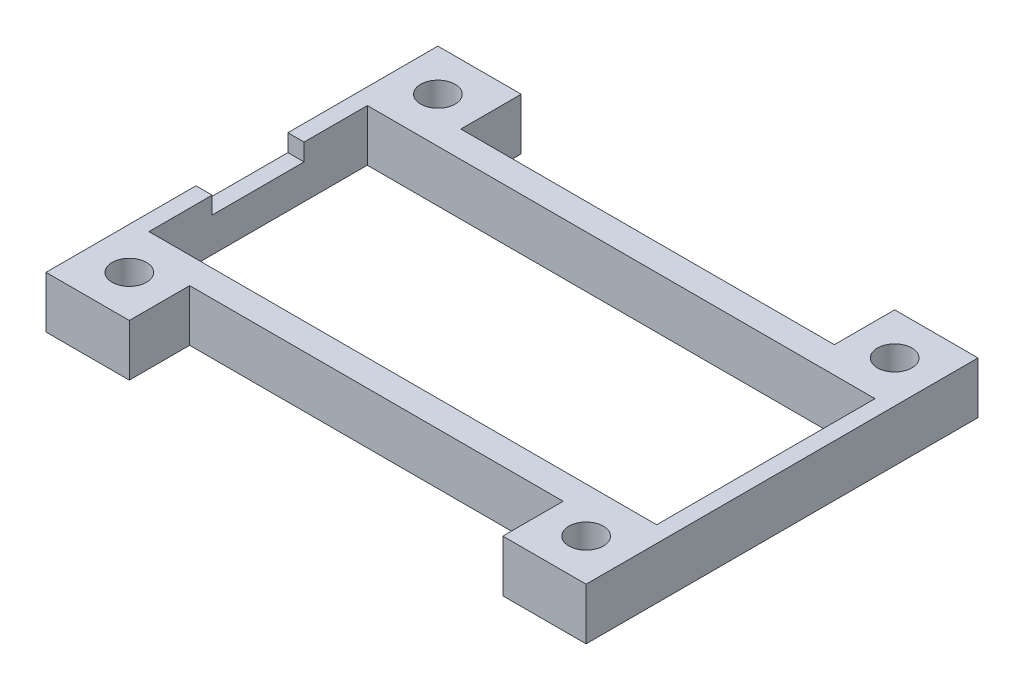
ISO-10303-21;
HEADER;
FILE_DESCRIPTION(('STEP AP214'),'2;1');
FILE_NAME('part.step','',(''),(''),'','','');
FILE_SCHEMA(('AUTOMOTIVE_DESIGN { 1 0 10303 214 1 1 1 1 }'));
ENDSEC;
DATA;
#1=APPLICATION_CONTEXT('core data for automotive mechanical design processes');
#2=APPLICATION_PROTOCOL_DEFINITION('international standard','automotive_design',2000,#1);
#3=PRODUCT_CONTEXT('',#1,'mechanical');
#4=PRODUCT('Part','Part','',(#3));
#5=PRODUCT_RELATED_PRODUCT_CATEGORY('part','',(#4));
#6=PRODUCT_DEFINITION_FORMATION('','',#4);
#7=PRODUCT_DEFINITION_CONTEXT('part definition',#1,'design');
#8=PRODUCT_DEFINITION('design','',#6,#7);
#9=PRODUCT_DEFINITION_SHAPE('','',#8);
#10=(LENGTH_UNIT() NAMED_UNIT(*) SI_UNIT(.MILLI.,.METRE.));
#11=(NAMED_UNIT(*) PLANE_ANGLE_UNIT() SI_UNIT($,.RADIAN.));
#12=(NAMED_UNIT(*) SI_UNIT($,.STERADIAN.) SOLID_ANGLE_UNIT());
#13=UNCERTAINTY_MEASURE_WITH_UNIT(LENGTH_MEASURE(1.E-05),#10,'distance_accuracy_value','');
#14=(GEOMETRIC_REPRESENTATION_CONTEXT(3) GLOBAL_UNCERTAINTY_ASSIGNED_CONTEXT((#13)) GLOBAL_UNIT_ASSIGNED_CONTEXT((#10,
#11,#12)) REPRESENTATION_CONTEXT('',''));
#15=CARTESIAN_POINT('',(0.,0.,0.));
#16=DIRECTION('',(0.,0.,1.));
#17=DIRECTION('',(1.,0.,0.));
#18=AXIS2_PLACEMENT_3D('',#15,#16,#17);
#19=CARTESIAN_POINT('',(-1.41,4.5,-21.3));
#20=DIRECTION('',(0.,0.,1.));
#21=DIRECTION('',(1.,0.,0.));
#22=AXIS2_PLACEMENT_3D('',#19,#20,#21);
#23=PLANE('',#22);
#24=DIRECTION('',(0.,-1.,0.));
#25=VECTOR('',#24,1.);
#26=CARTESIAN_POINT('',(5.84,4.5,-21.3));
#27=LINE('',#26,#25);
#28=CARTESIAN_POINT('',(5.84,4.5,-21.3));
#29=VERTEX_POINT('',#28);
#30=CARTESIAN_POINT('',(5.84,0.,-21.3));
#31=VERTEX_POINT('',#30);
#32=EDGE_CURVE('E218',#29,#31,#27,.T.);
#33=ORIENTED_EDGE('',*,*,#32,.F.);
#34=DIRECTION('',(-1.,0.,0.));
#35=VECTOR('',#34,1.);
#36=CARTESIAN_POINT('',(-1.41,4.5,-21.3));
#37=LINE('',#36,#35);
#38=CARTESIAN_POINT('',(38.34,4.5,-21.3));
#39=VERTEX_POINT('',#38);
#40=EDGE_CURVE('E11',#39,#29,#37,.T.);
#41=ORIENTED_EDGE('',*,*,#40,.F.);
#42=DIRECTION('',(0.,1.,0.));
#43=VECTOR('',#42,1.);
#44=CARTESIAN_POINT('',(38.34,4.5,-21.3));
#45=LINE('',#44,#43);
#46=CARTESIAN_POINT('',(38.34,0.,-21.3));
#47=VERTEX_POINT('',#46);
#48=EDGE_CURVE('E57',#47,#39,#45,.T.);
#49=ORIENTED_EDGE('',*,*,#48,.F.);
#50=DIRECTION('',(-1.,0.,0.));
#51=VECTOR('',#50,1.);
#52=CARTESIAN_POINT('',(-1.41,0.,-21.3));
#53=LINE('',#52,#51);
#54=EDGE_CURVE('E316',#47,#31,#53,.T.);
#55=ORIENTED_EDGE('',*,*,#54,.T.);
#56=EDGE_LOOP('',(#33,#41,#49,#55));
#57=FACE_BOUND('',#56,.T.);
#58=ADVANCED_FACE('F32',(#57),#23,.F.);
#59=CARTESIAN_POINT('',(-1.41,4.5,2.3));
#60=DIRECTION('',(0.,0.,-1.));
#61=DIRECTION('',(-1.,0.,0.));
#62=AXIS2_PLACEMENT_3D('',#59,#60,#61);
#63=PLANE('',#62);
#64=DIRECTION('',(0.,-1.,0.));
#65=VECTOR('',#64,1.);
#66=CARTESIAN_POINT('',(38.34,4.5,2.3));
#67=LINE('',#66,#65);
#68=CARTESIAN_POINT('',(38.34,4.5,2.3));
#69=VERTEX_POINT('',#68);
#70=CARTESIAN_POINT('',(38.34,0.,2.3));
#71=VERTEX_POINT('',#70);
#72=EDGE_CURVE('E257',#69,#71,#67,.T.);
#73=ORIENTED_EDGE('',*,*,#72,.F.);
#74=DIRECTION('',(1.,0.,0.));
#75=VECTOR('',#74,1.);
#76=CARTESIAN_POINT('',(-1.41,4.5,2.3));
#77=LINE('',#76,#75);
#78=CARTESIAN_POINT('',(5.84,4.5,2.3));
#79=VERTEX_POINT('',#78);
#80=EDGE_CURVE('E332',#79,#69,#77,.T.);
#81=ORIENTED_EDGE('',*,*,#80,.F.);
#82=DIRECTION('',(0.,1.,0.));
#83=VECTOR('',#82,1.);
#84=CARTESIAN_POINT('',(5.84,4.5,2.3));
#85=LINE('',#84,#83);
#86=CARTESIAN_POINT('',(5.84,0.,2.3));
#87=VERTEX_POINT('',#86);
#88=EDGE_CURVE('E351',#87,#79,#85,.T.);
#89=ORIENTED_EDGE('',*,*,#88,.F.);
#90=DIRECTION('',(1.,0.,0.));
#91=VECTOR('',#90,1.);
#92=CARTESIAN_POINT('',(-1.41,0.,2.3));
#93=LINE('',#92,#91);
#94=EDGE_CURVE('E317',#87,#71,#93,.T.);
#95=ORIENTED_EDGE('',*,*,#94,.T.);
#96=EDGE_LOOP('',(#73,#81,#89,#95));
#97=FACE_BOUND('',#96,.T.);
#98=ADVANCED_FACE('F286',(#97),#63,.F.);
#99=CARTESIAN_POINT('',(0.,4.5,0.));
#100=DIRECTION('',(0.,1.,0.));
#101=DIRECTION('',(0.,0.,1.));
#102=AXIS2_PLACEMENT_3D('',#99,#100,#101);
#103=PLANE('',#102);
#104=DIRECTION('',(-1.,0.,0.));
#105=VECTOR('',#104,1.);
#106=CARTESIAN_POINT('',(-1.41,4.5,-13.5));
#107=LINE('',#106,#105);
#108=CARTESIAN_POINT('',(0.,4.5,-13.5));
#109=VERTEX_POINT('',#108);
#110=CARTESIAN_POINT('',(-1.41,4.5,-13.5));
#111=VERTEX_POINT('',#110);
#112=EDGE_CURVE('E187',#109,#111,#107,.T.);
#113=ORIENTED_EDGE('',*,*,#112,.F.);
#114=DIRECTION('',(0.,0.,1.));
#115=VECTOR('',#114,1.);
#116=CARTESIAN_POINT('',(0.,4.5,0.));
#117=LINE('',#116,#115);
#118=CARTESIAN_POINT('',(0.,4.5,-19.));
#119=VERTEX_POINT('',#118);
#120=EDGE_CURVE('E364',#119,#109,#117,.T.);
#121=ORIENTED_EDGE('',*,*,#120,.F.);
#122=DIRECTION('',(-1.,0.,0.));
#123=VECTOR('',#122,1.);
#124=CARTESIAN_POINT('',(0.,4.5,-19.));
#125=LINE('',#124,#123);
#126=CARTESIAN_POINT('',(44.18,4.5,-19.));
#127=VERTEX_POINT('',#126);
#128=EDGE_CURVE('E373',#127,#119,#125,.T.);
#129=ORIENTED_EDGE('',*,*,#128,.F.);
#130=DIRECTION('',(0.,0.,-1.));
#131=VECTOR('',#130,1.);
#132=CARTESIAN_POINT('',(44.18,4.5,0.));
#133=LINE('',#132,#131);
#134=CARTESIAN_POINT('',(44.18,4.5,0.));
#135=VERTEX_POINT('',#134);
#136=EDGE_CURVE('E370',#135,#127,#133,.T.);
#137=ORIENTED_EDGE('',*,*,#136,.F.);
#138=DIRECTION('',(1.,0.,0.));
#139=VECTOR('',#138,1.);
#140=CARTESIAN_POINT('',(0.,4.5,0.));
#141=LINE('',#140,#139);
#142=CARTESIAN_POINT('',(0.,4.5,0.));
#143=VERTEX_POINT('',#142);
#144=EDGE_CURVE('E367',#143,#135,#141,.T.);
#145=ORIENTED_EDGE('',*,*,#144,.F.);
#146=CARTESIAN_POINT('',(0.,4.5,-5.5));
#147=VERTEX_POINT('',#146);
#148=EDGE_CURVE('E368',#147,#143,#117,.T.);
#149=ORIENTED_EDGE('',*,*,#148,.F.);
#150=DIRECTION('',(1.,0.,0.));
#151=VECTOR('',#150,1.);
#152=CARTESIAN_POINT('',(-1.41,4.5,-5.5));
#153=LINE('',#152,#151);
#154=CARTESIAN_POINT('',(-1.41,4.5,-5.5));
#155=VERTEX_POINT('',#154);
#156=EDGE_CURVE('E673',#155,#147,#153,.T.);
#157=ORIENTED_EDGE('',*,*,#156,.F.);
#158=DIRECTION('',(0.,0.,1.));
#159=VECTOR('',#158,1.);
#160=CARTESIAN_POINT('',(-1.41,4.5,-21.3));
#161=LINE('',#160,#159);
#162=CARTESIAN_POINT('',(-1.41,4.5,7.55));
#163=VERTEX_POINT('',#162);
#164=EDGE_CURVE('E191',#155,#163,#161,.T.);
#165=ORIENTED_EDGE('',*,*,#164,.T.);
#166=DIRECTION('',(-1.,0.,0.));
#167=VECTOR('',#166,1.);
#168=CARTESIAN_POINT('',(-1.41,4.5,7.55));
#169=LINE('',#168,#167);
#170=CARTESIAN_POINT('',(5.84,4.5,7.55));
#171=VERTEX_POINT('',#170);
#172=EDGE_CURVE('E362',#171,#163,#169,.T.);
#173=ORIENTED_EDGE('',*,*,#172,.F.);
#174=DIRECTION('',(0.,0.,-1.));
#175=VECTOR('',#174,1.);
#176=CARTESIAN_POINT('',(5.84,4.5,7.55));
#177=LINE('',#176,#175);
#178=EDGE_CURVE('E357',#171,#79,#177,.T.);
#179=ORIENTED_EDGE('',*,*,#178,.T.);
#180=ORIENTED_EDGE('',*,*,#80,.T.);
#181=DIRECTION('',(0.,0.,-1.));
#182=VECTOR('',#181,1.);
#183=CARTESIAN_POINT('',(38.34,4.5,7.55));
#184=LINE('',#183,#182);
#185=CARTESIAN_POINT('',(38.34,4.5,7.55));
#186=VERTEX_POINT('',#185);
#187=EDGE_CURVE('E356',#186,#69,#184,.T.);
#188=ORIENTED_EDGE('',*,*,#187,.F.);
#189=DIRECTION('',(-1.,0.,0.));
#190=VECTOR('',#189,1.);
#191=CARTESIAN_POINT('',(45.59,4.5,7.55));
#192=LINE('',#191,#190);
#193=CARTESIAN_POINT('',(45.59,4.5,7.55));
#194=VERTEX_POINT('',#193);
#195=EDGE_CURVE('E331',#194,#186,#192,.T.);
#196=ORIENTED_EDGE('',*,*,#195,.F.);
#197=DIRECTION('',(0.,0.,-1.));
#198=VECTOR('',#197,1.);
#199=CARTESIAN_POINT('',(45.59,4.5,-21.3));
#200=LINE('',#199,#198);
#201=CARTESIAN_POINT('',(45.59,4.5,-26.55));
#202=VERTEX_POINT('',#201);
#203=EDGE_CURVE('E41',#194,#202,#200,.T.);
#204=ORIENTED_EDGE('',*,*,#203,.T.);
#205=DIRECTION('',(1.,0.,0.));
#206=VECTOR('',#205,1.);
#207=CARTESIAN_POINT('',(45.59,4.5,-26.55));
#208=LINE('',#207,#206);
#209=CARTESIAN_POINT('',(38.34,4.5,-26.55));
#210=VERTEX_POINT('',#209);
#211=EDGE_CURVE('E238',#210,#202,#208,.T.);
#212=ORIENTED_EDGE('',*,*,#211,.F.);
#213=DIRECTION('',(0.,0.,1.));
#214=VECTOR('',#213,1.);
#215=CARTESIAN_POINT('',(38.34,4.5,-26.55));
#216=LINE('',#215,#214);
#217=EDGE_CURVE('E241',#210,#39,#216,.T.);
#218=ORIENTED_EDGE('',*,*,#217,.T.);
#219=ORIENTED_EDGE('',*,*,#40,.T.);
#220=DIRECTION('',(0.,0.,1.));
#221=VECTOR('',#220,1.);
#222=CARTESIAN_POINT('',(5.84,4.5,-26.55));
#223=LINE('',#222,#221);
#224=CARTESIAN_POINT('',(5.84,4.5,-26.55));
#225=VERTEX_POINT('',#224);
#226=EDGE_CURVE('E229',#225,#29,#223,.T.);
#227=ORIENTED_EDGE('',*,*,#226,.F.);
#228=DIRECTION('',(1.,0.,0.));
#229=VECTOR('',#228,1.);
#230=CARTESIAN_POINT('',(-1.41,4.5,-26.55));
#231=LINE('',#230,#229);
#232=CARTESIAN_POINT('',(-1.41,4.5,-26.55));
#233=VERTEX_POINT('',#232);
#234=EDGE_CURVE('E217',#233,#225,#231,.T.);
#235=ORIENTED_EDGE('',*,*,#234,.F.);
#236=EDGE_CURVE('E335',#233,#111,#161,.T.);
#237=ORIENTED_EDGE('',*,*,#236,.T.);
#238=EDGE_LOOP('',(#113,#121,#129,#137,#145,#149,#157,#165,#173,#179,#180,#188,#196,#204,#212,
#218,#219,#227,#235,#237));
#239=FACE_BOUND('',#238,.T.);
#240=CARTESIAN_POINT('',(2.215,4.5,-22.925));
#241=DIRECTION('',(0.,1.,0.));
#242=DIRECTION('',(0.,0.,-1.));
#243=AXIS2_PLACEMENT_3D('',#240,#241,#242);
#244=CIRCLE('',#243,1.5);
#245=CARTESIAN_POINT('',(2.215,4.5,-24.425));
#246=VERTEX_POINT('',#245);
#247=EDGE_CURVE('E198',#246,#246,#244,.T.);
#248=ORIENTED_EDGE('',*,*,#247,.F.);
#249=EDGE_LOOP('',(#248));
#250=FACE_BOUND('',#249,.T.);
#251=CARTESIAN_POINT('',(2.21500000000001,4.5,3.92500000000002));
#252=DIRECTION('',(0.,1.,0.));
#253=DIRECTION('',(0.,0.,1.));
#254=AXIS2_PLACEMENT_3D('',#251,#252,#253);
#255=CIRCLE('',#254,1.5);
#256=CARTESIAN_POINT('',(2.21500000000001,4.5,5.42500000000002));
#257=VERTEX_POINT('',#256);
#258=EDGE_CURVE('E202',#257,#257,#255,.T.);
#259=ORIENTED_EDGE('',*,*,#258,.F.);
#260=EDGE_LOOP('',(#259));
#261=FACE_BOUND('',#260,.T.);
#262=CARTESIAN_POINT('',(41.965,4.5,3.925));
#263=DIRECTION('',(0.,1.,0.));
#264=DIRECTION('',(0.,0.,-1.));
#265=AXIS2_PLACEMENT_3D('',#262,#263,#264);
#266=CIRCLE('',#265,1.5);
#267=CARTESIAN_POINT('',(41.965,4.5,2.425));
#268=VERTEX_POINT('',#267);
#269=EDGE_CURVE('E206',#268,#268,#266,.T.);
#270=ORIENTED_EDGE('',*,*,#269,.F.);
#271=EDGE_LOOP('',(#270));
#272=FACE_BOUND('',#271,.T.);
#273=CARTESIAN_POINT('',(41.965,4.5,-22.925));
#274=DIRECTION('',(0.,1.,0.));
#275=DIRECTION('',(0.,0.,1.));
#276=AXIS2_PLACEMENT_3D('',#273,#274,#275);
#277=CIRCLE('',#276,1.5);
#278=CARTESIAN_POINT('',(41.965,4.5,-21.425));
#279=VERTEX_POINT('',#278);
#280=EDGE_CURVE('E210',#279,#279,#277,.T.);
#281=ORIENTED_EDGE('',*,*,#280,.F.);
#282=EDGE_LOOP('',(#281));
#283=FACE_BOUND('',#282,.T.);
#284=ADVANCED_FACE('F291',(#239,#250,#261,#272,#283),#103,.T.);
#285=CARTESIAN_POINT('',(0.,0.,0.));
#286=DIRECTION('',(0.,1.,0.));
#287=DIRECTION('',(0.,0.,1.));
#288=AXIS2_PLACEMENT_3D('',#285,#286,#287);
#289=PLANE('',#288);
#290=CARTESIAN_POINT('',(2.215,0.,-22.925));
#291=DIRECTION('',(0.,1.,0.));
#292=DIRECTION('',(0.,0.,1.));
#293=AXIS2_PLACEMENT_3D('',#290,#291,#292);
#294=CIRCLE('',#293,1.5);
#295=CARTESIAN_POINT('',(2.215,0.,-21.425));
#296=VERTEX_POINT('',#295);
#297=EDGE_CURVE('E36',#296,#296,#294,.T.);
#298=ORIENTED_EDGE('',*,*,#297,.T.);
#299=EDGE_LOOP('',(#298));
#300=FACE_BOUND('',#299,.T.);
#301=CARTESIAN_POINT('',(2.21500000000001,0.,3.92500000000002));
#302=DIRECTION('',(0.,1.,0.));
#303=DIRECTION('',(0.,0.,1.));
#304=AXIS2_PLACEMENT_3D('',#301,#302,#303);
#305=CIRCLE('',#304,1.5);
#306=CARTESIAN_POINT('',(2.21500000000001,0.,5.42500000000002));
#307=VERTEX_POINT('',#306);
#308=EDGE_CURVE('E205',#307,#307,#305,.T.);
#309=ORIENTED_EDGE('',*,*,#308,.T.);
#310=EDGE_LOOP('',(#309));
#311=FACE_BOUND('',#310,.T.);
#312=CARTESIAN_POINT('',(41.965,0.,3.925));
#313=DIRECTION('',(0.,1.,0.));
#314=DIRECTION('',(0.,0.,1.));
#315=AXIS2_PLACEMENT_3D('',#312,#313,#314);
#316=CIRCLE('',#315,1.5);
#317=CARTESIAN_POINT('',(41.965,0.,5.42500000000001));
#318=VERTEX_POINT('',#317);
#319=EDGE_CURVE('E209',#318,#318,#316,.T.);
#320=ORIENTED_EDGE('',*,*,#319,.T.);
#321=EDGE_LOOP('',(#320));
#322=FACE_BOUND('',#321,.T.);
#323=CARTESIAN_POINT('',(41.965,0.,-22.925));
#324=DIRECTION('',(0.,1.,0.));
#325=DIRECTION('',(0.,0.,1.));
#326=AXIS2_PLACEMENT_3D('',#323,#324,#325);
#327=CIRCLE('',#326,1.5);
#328=CARTESIAN_POINT('',(41.965,0.,-21.425));
#329=VERTEX_POINT('',#328);
#330=EDGE_CURVE('E213',#329,#329,#327,.T.);
#331=ORIENTED_EDGE('',*,*,#330,.T.);
#332=EDGE_LOOP('',(#331));
#333=FACE_BOUND('',#332,.T.);
#334=DIRECTION('',(0.,0.,1.));
#335=VECTOR('',#334,1.);
#336=CARTESIAN_POINT('',(-1.41,0.,-21.3));
#337=LINE('',#336,#335);
#338=CARTESIAN_POINT('',(-1.41,0.,-26.55));
#339=VERTEX_POINT('',#338);
#340=CARTESIAN_POINT('',(-1.41,0.,7.55));
#341=VERTEX_POINT('',#340);
#342=EDGE_CURVE('E342',#339,#341,#337,.T.);
#343=ORIENTED_EDGE('',*,*,#342,.F.);
#344=DIRECTION('',(-1.,0.,0.));
#345=VECTOR('',#344,1.);
#346=CARTESIAN_POINT('',(-1.41,0.,-26.55));
#347=LINE('',#346,#345);
#348=CARTESIAN_POINT('',(5.84,0.,-26.55));
#349=VERTEX_POINT('',#348);
#350=EDGE_CURVE('E222',#349,#339,#347,.T.);
#351=ORIENTED_EDGE('',*,*,#350,.F.);
#352=DIRECTION('',(0.,0.,1.));
#353=VECTOR('',#352,1.);
#354=CARTESIAN_POINT('',(5.84,0.,-26.55));
#355=LINE('',#354,#353);
#356=EDGE_CURVE('E225',#349,#31,#355,.T.);
#357=ORIENTED_EDGE('',*,*,#356,.T.);
#358=ORIENTED_EDGE('',*,*,#54,.F.);
#359=DIRECTION('',(0.,0.,1.));
#360=VECTOR('',#359,1.);
#361=CARTESIAN_POINT('',(38.34,0.,-26.55));
#362=LINE('',#361,#360);
#363=CARTESIAN_POINT('',(38.34,0.,-26.55));
#364=VERTEX_POINT('',#363);
#365=EDGE_CURVE('E252',#364,#47,#362,.T.);
#366=ORIENTED_EDGE('',*,*,#365,.F.);
#367=DIRECTION('',(-1.,0.,0.));
#368=VECTOR('',#367,1.);
#369=CARTESIAN_POINT('',(45.59,0.,-26.55));
#370=LINE('',#369,#368);
#371=CARTESIAN_POINT('',(45.59,0.,-26.55));
#372=VERTEX_POINT('',#371);
#373=EDGE_CURVE('E234',#372,#364,#370,.T.);
#374=ORIENTED_EDGE('',*,*,#373,.F.);
#375=DIRECTION('',(0.,0.,-1.));
#376=VECTOR('',#375,1.);
#377=CARTESIAN_POINT('',(45.59,0.,-21.3));
#378=LINE('',#377,#376);
#379=CARTESIAN_POINT('',(45.59,0.,7.55));
#380=VERTEX_POINT('',#379);
#381=EDGE_CURVE('E310',#380,#372,#378,.T.);
#382=ORIENTED_EDGE('',*,*,#381,.F.);
#383=DIRECTION('',(1.,0.,0.));
#384=VECTOR('',#383,1.);
#385=CARTESIAN_POINT('',(45.59,0.,7.55));
#386=LINE('',#385,#384);
#387=CARTESIAN_POINT('',(38.34,0.,7.55));
#388=VERTEX_POINT('',#387);
#389=EDGE_CURVE('E421',#388,#380,#386,.T.);
#390=ORIENTED_EDGE('',*,*,#389,.F.);
#391=DIRECTION('',(0.,0.,-1.));
#392=VECTOR('',#391,1.);
#393=CARTESIAN_POINT('',(38.34,0.,7.55));
#394=LINE('',#393,#392);
#395=EDGE_CURVE('E418',#388,#71,#394,.T.);
#396=ORIENTED_EDGE('',*,*,#395,.T.);
#397=ORIENTED_EDGE('',*,*,#94,.F.);
#398=DIRECTION('',(0.,0.,-1.));
#399=VECTOR('',#398,1.);
#400=CARTESIAN_POINT('',(5.84,0.,7.55));
#401=LINE('',#400,#399);
#402=CARTESIAN_POINT('',(5.84,0.,7.55));
#403=VERTEX_POINT('',#402);
#404=EDGE_CURVE('E380',#403,#87,#401,.T.);
#405=ORIENTED_EDGE('',*,*,#404,.F.);
#406=DIRECTION('',(1.,0.,0.));
#407=VECTOR('',#406,1.);
#408=CARTESIAN_POINT('',(-1.41,0.,7.55));
#409=LINE('',#408,#407);
#410=EDGE_CURVE('E413',#341,#403,#409,.T.);
#411=ORIENTED_EDGE('',*,*,#410,.F.);
#412=EDGE_LOOP('',(#343,#351,#357,#358,#366,#374,#382,#390,#396,#397,#405,#411));
#413=FACE_BOUND('',#412,.T.);
#414=DIRECTION('',(0.,0.,1.));
#415=VECTOR('',#414,1.);
#416=CARTESIAN_POINT('',(0.,0.,0.));
#417=LINE('',#416,#415);
#418=CARTESIAN_POINT('',(0.,0.,-19.));
#419=VERTEX_POINT('',#418);
#420=CARTESIAN_POINT('',(0.,0.,0.));
#421=VERTEX_POINT('',#420);
#422=EDGE_CURVE('E376',#419,#421,#417,.T.);
#423=ORIENTED_EDGE('',*,*,#422,.T.);
#424=DIRECTION('',(1.,0.,0.));
#425=VECTOR('',#424,1.);
#426=CARTESIAN_POINT('',(0.,0.,0.));
#427=LINE('',#426,#425);
#428=CARTESIAN_POINT('',(44.18,0.,0.));
#429=VERTEX_POINT('',#428);
#430=EDGE_CURVE('E379',#421,#429,#427,.T.);
#431=ORIENTED_EDGE('',*,*,#430,.T.);
#432=DIRECTION('',(0.,0.,-1.));
#433=VECTOR('',#432,1.);
#434=CARTESIAN_POINT('',(44.18,0.,0.));
#435=LINE('',#434,#433);
#436=CARTESIAN_POINT('',(44.18,0.,-19.));
#437=VERTEX_POINT('',#436);
#438=EDGE_CURVE('E383',#429,#437,#435,.T.);
#439=ORIENTED_EDGE('',*,*,#438,.T.);
#440=DIRECTION('',(-1.,0.,0.));
#441=VECTOR('',#440,1.);
#442=CARTESIAN_POINT('',(0.,0.,-19.));
#443=LINE('',#442,#441);
#444=EDGE_CURVE('E386',#437,#419,#443,.T.);
#445=ORIENTED_EDGE('',*,*,#444,.T.);
#446=EDGE_LOOP('',(#423,#431,#439,#445));
#447=FACE_BOUND('',#446,.T.);
#448=ADVANCED_FACE('F266',(#300,#311,#322,#333,#413,#447),#289,.F.);
#449=CARTESIAN_POINT('',(-1.41,4.5,-21.3));
#450=DIRECTION('',(1.,0.,0.));
#451=DIRECTION('',(0.,0.,-1.));
#452=AXIS2_PLACEMENT_3D('',#449,#450,#451);
#453=PLANE('',#452);
#454=DIRECTION('',(0.,0.,1.));
#455=VECTOR('',#454,1.);
#456=CARTESIAN_POINT('',(-1.41,3.,-13.5));
#457=LINE('',#456,#455);
#458=CARTESIAN_POINT('',(-1.41,3.,-13.5));
#459=VERTEX_POINT('',#458);
#460=CARTESIAN_POINT('',(-1.41,3.,-5.5));
#461=VERTEX_POINT('',#460);
#462=EDGE_CURVE('E178',#459,#461,#457,.T.);
#463=ORIENTED_EDGE('',*,*,#462,.F.);
#464=DIRECTION('',(0.,1.,0.));
#465=VECTOR('',#464,1.);
#466=CARTESIAN_POINT('',(-1.41,3.,-13.5));
#467=LINE('',#466,#465);
#468=EDGE_CURVE('E201',#459,#111,#467,.T.);
#469=ORIENTED_EDGE('',*,*,#468,.T.);
#470=ORIENTED_EDGE('',*,*,#236,.F.);
#471=DIRECTION('',(0.,1.,0.));
#472=VECTOR('',#471,1.);
#473=CARTESIAN_POINT('',(-1.41,4.5,-26.55));
#474=LINE('',#473,#472);
#475=EDGE_CURVE('E214',#339,#233,#474,.T.);
#476=ORIENTED_EDGE('',*,*,#475,.F.);
#477=ORIENTED_EDGE('',*,*,#342,.T.);
#478=DIRECTION('',(0.,-1.,0.));
#479=VECTOR('',#478,1.);
#480=CARTESIAN_POINT('',(-1.41,4.5,7.55));
#481=LINE('',#480,#479);
#482=EDGE_CURVE('E355',#163,#341,#481,.T.);
#483=ORIENTED_EDGE('',*,*,#482,.F.);
#484=ORIENTED_EDGE('',*,*,#164,.F.);
#485=DIRECTION('',(0.,1.,0.));
#486=VECTOR('',#485,1.);
#487=CARTESIAN_POINT('',(-1.41,3.,-5.5));
#488=LINE('',#487,#486);
#489=EDGE_CURVE('E172',#461,#155,#488,.T.);
#490=ORIENTED_EDGE('',*,*,#489,.F.);
#491=EDGE_LOOP('',(#463,#469,#470,#476,#477,#483,#484,#490));
#492=FACE_BOUND('',#491,.T.);
#493=ADVANCED_FACE('F34',(#492),#453,.F.);
#494=CARTESIAN_POINT('',(45.59,4.5,-21.3));
#495=DIRECTION('',(-1.,0.,0.));
#496=DIRECTION('',(0.,0.,1.));
#497=AXIS2_PLACEMENT_3D('',#494,#495,#496);
#498=PLANE('',#497);
#499=ORIENTED_EDGE('',*,*,#381,.T.);
#500=DIRECTION('',(0.,-1.,0.));
#501=VECTOR('',#500,1.);
#502=CARTESIAN_POINT('',(45.59,4.5,-26.55));
#503=LINE('',#502,#501);
#504=EDGE_CURVE('E231',#202,#372,#503,.T.);
#505=ORIENTED_EDGE('',*,*,#504,.F.);
#506=ORIENTED_EDGE('',*,*,#203,.F.);
#507=DIRECTION('',(0.,1.,0.));
#508=VECTOR('',#507,1.);
#509=CARTESIAN_POINT('',(45.59,4.5,7.55));
#510=LINE('',#509,#508);
#511=EDGE_CURVE('E244',#380,#194,#510,.T.);
#512=ORIENTED_EDGE('',*,*,#511,.F.);
#513=EDGE_LOOP('',(#499,#505,#506,#512));
#514=FACE_BOUND('',#513,.T.);
#515=ADVANCED_FACE('F297',(#514),#498,.F.);
#516=CARTESIAN_POINT('',(0.,4.5,0.));
#517=DIRECTION('',(1.,0.,0.));
#518=DIRECTION('',(0.,0.,-1.));
#519=AXIS2_PLACEMENT_3D('',#516,#517,#518);
#520=PLANE('',#519);
#521=DIRECTION('',(0.,1.,0.));
#522=VECTOR('',#521,1.);
#523=CARTESIAN_POINT('',(0.,3.,-13.5));
#524=LINE('',#523,#522);
#525=CARTESIAN_POINT('',(0.,3.,-13.5));
#526=VERTEX_POINT('',#525);
#527=EDGE_CURVE('E193',#526,#109,#524,.T.);
#528=ORIENTED_EDGE('',*,*,#527,.F.);
#529=DIRECTION('',(0.,0.,-1.));
#530=VECTOR('',#529,1.);
#531=CARTESIAN_POINT('',(0.,3.,-13.5));
#532=LINE('',#531,#530);
#533=CARTESIAN_POINT('',(0.,3.,-5.5));
#534=VERTEX_POINT('',#533);
#535=EDGE_CURVE('E177',#534,#526,#532,.T.);
#536=ORIENTED_EDGE('',*,*,#535,.F.);
#537=DIRECTION('',(0.,1.,0.));
#538=VECTOR('',#537,1.);
#539=CARTESIAN_POINT('',(0.,3.,-5.5));
#540=LINE('',#539,#538);
#541=EDGE_CURVE('E175',#534,#147,#540,.T.);
#542=ORIENTED_EDGE('',*,*,#541,.T.);
#543=ORIENTED_EDGE('',*,*,#148,.T.);
#544=DIRECTION('',(0.,-1.,0.));
#545=VECTOR('',#544,1.);
#546=CARTESIAN_POINT('',(0.,4.5,0.));
#547=LINE('',#546,#545);
#548=EDGE_CURVE('E344',#143,#421,#547,.T.);
#549=ORIENTED_EDGE('',*,*,#548,.T.);
#550=ORIENTED_EDGE('',*,*,#422,.F.);
#551=DIRECTION('',(0.,-1.,0.));
#552=VECTOR('',#551,1.);
#553=CARTESIAN_POINT('',(0.,4.5,-19.));
#554=LINE('',#553,#552);
#555=EDGE_CURVE('E375',#119,#419,#554,.T.);
#556=ORIENTED_EDGE('',*,*,#555,.F.);
#557=ORIENTED_EDGE('',*,*,#120,.T.);
#558=EDGE_LOOP('',(#528,#536,#542,#543,#549,#550,#556,#557));
#559=FACE_BOUND('',#558,.T.);
#560=ADVANCED_FACE('F299',(#559),#520,.T.);
#561=CARTESIAN_POINT('',(0.,4.5,0.));
#562=DIRECTION('',(0.,0.,-1.));
#563=DIRECTION('',(-1.,0.,0.));
#564=AXIS2_PLACEMENT_3D('',#561,#562,#563);
#565=PLANE('',#564);
#566=ORIENTED_EDGE('',*,*,#430,.F.);
#567=ORIENTED_EDGE('',*,*,#548,.F.);
#568=ORIENTED_EDGE('',*,*,#144,.T.);
#569=DIRECTION('',(0.,-1.,0.));
#570=VECTOR('',#569,1.);
#571=CARTESIAN_POINT('',(44.18,4.5,0.));
#572=LINE('',#571,#570);
#573=EDGE_CURVE('E393',#135,#429,#572,.T.);
#574=ORIENTED_EDGE('',*,*,#573,.T.);
#575=EDGE_LOOP('',(#566,#567,#568,#574));
#576=FACE_BOUND('',#575,.T.);
#577=ADVANCED_FACE('F305',(#576),#565,.T.);
#578=CARTESIAN_POINT('',(44.18,4.5,0.));
#579=DIRECTION('',(-1.,0.,0.));
#580=DIRECTION('',(0.,0.,1.));
#581=AXIS2_PLACEMENT_3D('',#578,#579,#580);
#582=PLANE('',#581);
#583=ORIENTED_EDGE('',*,*,#438,.F.);
#584=ORIENTED_EDGE('',*,*,#573,.F.);
#585=ORIENTED_EDGE('',*,*,#136,.T.);
#586=DIRECTION('',(0.,-1.,0.));
#587=VECTOR('',#586,1.);
#588=CARTESIAN_POINT('',(44.18,4.5,-19.));
#589=LINE('',#588,#587);
#590=EDGE_CURVE('E391',#127,#437,#589,.T.);
#591=ORIENTED_EDGE('',*,*,#590,.T.);
#592=EDGE_LOOP('',(#583,#584,#585,#591));
#593=FACE_BOUND('',#592,.T.);
#594=ADVANCED_FACE('F443',(#593),#582,.T.);
#595=CARTESIAN_POINT('',(0.,4.5,-19.));
#596=DIRECTION('',(0.,0.,1.));
#597=DIRECTION('',(1.,0.,0.));
#598=AXIS2_PLACEMENT_3D('',#595,#596,#597);
#599=PLANE('',#598);
#600=ORIENTED_EDGE('',*,*,#444,.F.);
#601=ORIENTED_EDGE('',*,*,#590,.F.);
#602=ORIENTED_EDGE('',*,*,#128,.T.);
#603=ORIENTED_EDGE('',*,*,#555,.T.);
#604=EDGE_LOOP('',(#600,#601,#602,#603));
#605=FACE_BOUND('',#604,.T.);
#606=ADVANCED_FACE('F435',(#605),#599,.T.);
#607=CARTESIAN_POINT('',(5.84,4.5,7.55));
#608=DIRECTION('',(-1.,0.,0.));
#609=DIRECTION('',(0.,-1.,0.));
#610=AXIS2_PLACEMENT_3D('',#607,#608,#609);
#611=PLANE('',#610);
#612=ORIENTED_EDGE('',*,*,#88,.T.);
#613=ORIENTED_EDGE('',*,*,#178,.F.);
#614=DIRECTION('',(0.,1.,0.));
#615=VECTOR('',#614,1.);
#616=CARTESIAN_POINT('',(5.84,4.5,7.55));
#617=LINE('',#616,#615);
#618=EDGE_CURVE('E410',#403,#171,#617,.T.);
#619=ORIENTED_EDGE('',*,*,#618,.F.);
#620=ORIENTED_EDGE('',*,*,#404,.T.);
#621=EDGE_LOOP('',(#612,#613,#619,#620));
#622=FACE_BOUND('',#621,.T.);
#623=ADVANCED_FACE('F432',(#622),#611,.F.);
#624=CARTESIAN_POINT('',(0.,0.,7.55));
#625=DIRECTION('',(0.,0.,1.));
#626=DIRECTION('',(1.,0.,0.));
#627=AXIS2_PLACEMENT_3D('',#624,#625,#626);
#628=PLANE('',#627);
#629=ORIENTED_EDGE('',*,*,#482,.T.);
#630=ORIENTED_EDGE('',*,*,#410,.T.);
#631=ORIENTED_EDGE('',*,*,#618,.T.);
#632=ORIENTED_EDGE('',*,*,#172,.T.);
#633=EDGE_LOOP('',(#629,#630,#631,#632));
#634=FACE_BOUND('',#633,.T.);
#635=ADVANCED_FACE('F434',(#634),#628,.T.);
#636=CARTESIAN_POINT('',(38.34,4.5,7.55));
#637=DIRECTION('',(1.,0.,0.));
#638=DIRECTION('',(0.,0.,-1.));
#639=AXIS2_PLACEMENT_3D('',#636,#637,#638);
#640=PLANE('',#639);
#641=ORIENTED_EDGE('',*,*,#72,.T.);
#642=ORIENTED_EDGE('',*,*,#395,.F.);
#643=DIRECTION('',(0.,-1.,0.));
#644=VECTOR('',#643,1.);
#645=CARTESIAN_POINT('',(38.34,4.5,7.55));
#646=LINE('',#645,#644);
#647=EDGE_CURVE('E424',#186,#388,#646,.T.);
#648=ORIENTED_EDGE('',*,*,#647,.F.);
#649=ORIENTED_EDGE('',*,*,#187,.T.);
#650=EDGE_LOOP('',(#641,#642,#648,#649));
#651=FACE_BOUND('',#650,.T.);
#652=ADVANCED_FACE('F441',(#651),#640,.F.);
#653=CARTESIAN_POINT('',(0.,0.,7.55));
#654=DIRECTION('',(0.,0.,-1.));
#655=DIRECTION('',(-1.,0.,0.));
#656=AXIS2_PLACEMENT_3D('',#653,#654,#655);
#657=PLANE('',#656);
#658=ORIENTED_EDGE('',*,*,#511,.T.);
#659=ORIENTED_EDGE('',*,*,#195,.T.);
#660=ORIENTED_EDGE('',*,*,#647,.T.);
#661=ORIENTED_EDGE('',*,*,#389,.T.);
#662=EDGE_LOOP('',(#658,#659,#660,#661));
#663=FACE_BOUND('',#662,.T.);
#664=ADVANCED_FACE('F426',(#663),#657,.F.);
#665=CARTESIAN_POINT('',(38.34,4.5,-26.55));
#666=DIRECTION('',(1.,0.,0.));
#667=DIRECTION('',(0.,0.,-1.));
#668=AXIS2_PLACEMENT_3D('',#665,#666,#667);
#669=PLANE('',#668);
#670=ORIENTED_EDGE('',*,*,#48,.T.);
#671=ORIENTED_EDGE('',*,*,#217,.F.);
#672=DIRECTION('',(0.,1.,0.));
#673=VECTOR('',#672,1.);
#674=CARTESIAN_POINT('',(38.34,4.5,-26.55));
#675=LINE('',#674,#673);
#676=EDGE_CURVE('E236',#364,#210,#675,.T.);
#677=ORIENTED_EDGE('',*,*,#676,.F.);
#678=ORIENTED_EDGE('',*,*,#365,.T.);
#679=EDGE_LOOP('',(#670,#671,#677,#678));
#680=FACE_BOUND('',#679,.T.);
#681=ADVANCED_FACE('F553',(#680),#669,.F.);
#682=CARTESIAN_POINT('',(0.,0.,-26.55));
#683=DIRECTION('',(0.,0.,-1.));
#684=DIRECTION('',(-1.,0.,0.));
#685=AXIS2_PLACEMENT_3D('',#682,#683,#684);
#686=PLANE('',#685);
#687=ORIENTED_EDGE('',*,*,#504,.T.);
#688=ORIENTED_EDGE('',*,*,#373,.T.);
#689=ORIENTED_EDGE('',*,*,#676,.T.);
#690=ORIENTED_EDGE('',*,*,#211,.T.);
#691=EDGE_LOOP('',(#687,#688,#689,#690));
#692=FACE_BOUND('',#691,.T.);
#693=ADVANCED_FACE('F323',(#692),#686,.T.);
#694=CARTESIAN_POINT('',(5.84,4.5,-26.55));
#695=DIRECTION('',(-1.,0.,0.));
#696=DIRECTION('',(0.,-1.,0.));
#697=AXIS2_PLACEMENT_3D('',#694,#695,#696);
#698=PLANE('',#697);
#699=ORIENTED_EDGE('',*,*,#32,.T.);
#700=ORIENTED_EDGE('',*,*,#356,.F.);
#701=DIRECTION('',(0.,-1.,0.));
#702=VECTOR('',#701,1.);
#703=CARTESIAN_POINT('',(5.84,4.5,-26.55));
#704=LINE('',#703,#702);
#705=EDGE_CURVE('E220',#225,#349,#704,.T.);
#706=ORIENTED_EDGE('',*,*,#705,.F.);
#707=ORIENTED_EDGE('',*,*,#226,.T.);
#708=EDGE_LOOP('',(#699,#700,#706,#707));
#709=FACE_BOUND('',#708,.T.);
#710=ADVANCED_FACE('F539',(#709),#698,.F.);
#711=CARTESIAN_POINT('',(0.,0.,-26.55));
#712=DIRECTION('',(0.,0.,1.));
#713=DIRECTION('',(1.,0.,0.));
#714=AXIS2_PLACEMENT_3D('',#711,#712,#713);
#715=PLANE('',#714);
#716=ORIENTED_EDGE('',*,*,#475,.T.);
#717=ORIENTED_EDGE('',*,*,#234,.T.);
#718=ORIENTED_EDGE('',*,*,#705,.T.);
#719=ORIENTED_EDGE('',*,*,#350,.T.);
#720=EDGE_LOOP('',(#716,#717,#718,#719));
#721=FACE_BOUND('',#720,.T.);
#722=ADVANCED_FACE('F529',(#721),#715,.F.);
#723=CARTESIAN_POINT('',(41.965,-4.99999999997031E-05,-22.925));
#724=DIRECTION('',(0.,1.,0.));
#725=DIRECTION('',(0.,0.,1.));
#726=AXIS2_PLACEMENT_3D('',#723,#724,#725);
#727=CYLINDRICAL_SURFACE('',#726,1.5);
#728=ORIENTED_EDGE('',*,*,#280,.T.);
#729=EDGE_LOOP('',(#728));
#730=FACE_BOUND('',#729,.T.);
#731=ORIENTED_EDGE('',*,*,#330,.F.);
#732=EDGE_LOOP('',(#731));
#733=FACE_BOUND('',#732,.T.);
#734=ADVANCED_FACE('F282',(#730,#733),#727,.F.);
#735=CARTESIAN_POINT('',(41.965,-4.99999999997031E-05,3.925));
#736=DIRECTION('',(0.,1.,0.));
#737=DIRECTION('',(0.,0.,1.));
#738=AXIS2_PLACEMENT_3D('',#735,#736,#737);
#739=CYLINDRICAL_SURFACE('',#738,1.5);
#740=ORIENTED_EDGE('',*,*,#269,.T.);
#741=EDGE_LOOP('',(#740));
#742=FACE_BOUND('',#741,.T.);
#743=ORIENTED_EDGE('',*,*,#319,.F.);
#744=EDGE_LOOP('',(#743));
#745=FACE_BOUND('',#744,.T.);
#746=ADVANCED_FACE('F272',(#742,#745),#739,.F.);
#747=CARTESIAN_POINT('',(2.21500000000001,-4.99999999997031E-05,3.92500000000002));
#748=DIRECTION('',(0.,1.,0.));
#749=DIRECTION('',(0.,0.,1.));
#750=AXIS2_PLACEMENT_3D('',#747,#748,#749);
#751=CYLINDRICAL_SURFACE('',#750,1.5);
#752=ORIENTED_EDGE('',*,*,#258,.T.);
#753=EDGE_LOOP('',(#752));
#754=FACE_BOUND('',#753,.T.);
#755=ORIENTED_EDGE('',*,*,#308,.F.);
#756=EDGE_LOOP('',(#755));
#757=FACE_BOUND('',#756,.T.);
#758=ADVANCED_FACE('F269',(#754,#757),#751,.F.);
#759=CARTESIAN_POINT('',(2.215,-4.99999999997031E-05,-22.925));
#760=DIRECTION('',(0.,1.,0.));
#761=DIRECTION('',(0.,0.,1.));
#762=AXIS2_PLACEMENT_3D('',#759,#760,#761);
#763=CYLINDRICAL_SURFACE('',#762,1.5);
#764=ORIENTED_EDGE('',*,*,#247,.T.);
#765=EDGE_LOOP('',(#764));
#766=FACE_BOUND('',#765,.T.);
#767=ORIENTED_EDGE('',*,*,#297,.F.);
#768=EDGE_LOOP('',(#767));
#769=FACE_BOUND('',#768,.T.);
#770=ADVANCED_FACE('F271',(#766,#769),#763,.F.);
#771=CARTESIAN_POINT('',(-1.41,3.,-13.5));
#772=DIRECTION('',(0.,0.,-1.));
#773=DIRECTION('',(-1.,0.,0.));
#774=AXIS2_PLACEMENT_3D('',#771,#772,#773);
#775=PLANE('',#774);
#776=ORIENTED_EDGE('',*,*,#112,.T.);
#777=ORIENTED_EDGE('',*,*,#468,.F.);
#778=DIRECTION('',(-1.,0.,0.));
#779=VECTOR('',#778,1.);
#780=CARTESIAN_POINT('',(-1.41,3.,-13.5));
#781=LINE('',#780,#779);
#782=EDGE_CURVE('E184',#526,#459,#781,.T.);
#783=ORIENTED_EDGE('',*,*,#782,.F.);
#784=ORIENTED_EDGE('',*,*,#527,.T.);
#785=EDGE_LOOP('',(#776,#777,#783,#784));
#786=FACE_BOUND('',#785,.T.);
#787=ADVANCED_FACE('F279',(#786),#775,.F.);
#788=CARTESIAN_POINT('',(-1.41,3.,-5.5));
#789=DIRECTION('',(0.,0.,1.));
#790=DIRECTION('',(1.,0.,0.));
#791=AXIS2_PLACEMENT_3D('',#788,#789,#790);
#792=PLANE('',#791);
#793=ORIENTED_EDGE('',*,*,#156,.T.);
#794=ORIENTED_EDGE('',*,*,#541,.F.);
#795=DIRECTION('',(1.,0.,0.));
#796=VECTOR('',#795,1.);
#797=CARTESIAN_POINT('',(-1.41,3.,-5.5));
#798=LINE('',#797,#796);
#799=EDGE_CURVE('E49',#461,#534,#798,.T.);
#800=ORIENTED_EDGE('',*,*,#799,.F.);
#801=ORIENTED_EDGE('',*,*,#489,.T.);
#802=EDGE_LOOP('',(#793,#794,#800,#801));
#803=FACE_BOUND('',#802,.T.);
#804=ADVANCED_FACE('F170',(#803),#792,.F.);
#805=CARTESIAN_POINT('',(0.,3.,0.));
#806=DIRECTION('',(0.,1.,0.));
#807=DIRECTION('',(0.,0.,1.));
#808=AXIS2_PLACEMENT_3D('',#805,#806,#807);
#809=PLANE('',#808);
#810=ORIENTED_EDGE('',*,*,#462,.T.);
#811=ORIENTED_EDGE('',*,*,#799,.T.);
#812=ORIENTED_EDGE('',*,*,#535,.T.);
#813=ORIENTED_EDGE('',*,*,#782,.T.);
#814=EDGE_LOOP('',(#810,#811,#812,#813));
#815=FACE_BOUND('',#814,.T.);
#816=ADVANCED_FACE('F182',(#815),#809,.T.);
#817=CLOSED_SHELL('',(#58,#98,#284,#448,#493,#515,#560,#577,#594,#606,#623,#635,#652,#664,#681,
#693,#710,#722,#734,#746,#758,#770,#787,#804,#816));
#818=MANIFOLD_SOLID_BREP('B2',#817);
#819=ADVANCED_BREP_SHAPE_REPRESENTATION('',(#18,#818),#14);
#820=SHAPE_DEFINITION_REPRESENTATION(#9,#819);
ENDSEC;
END-ISO-10303-21;
